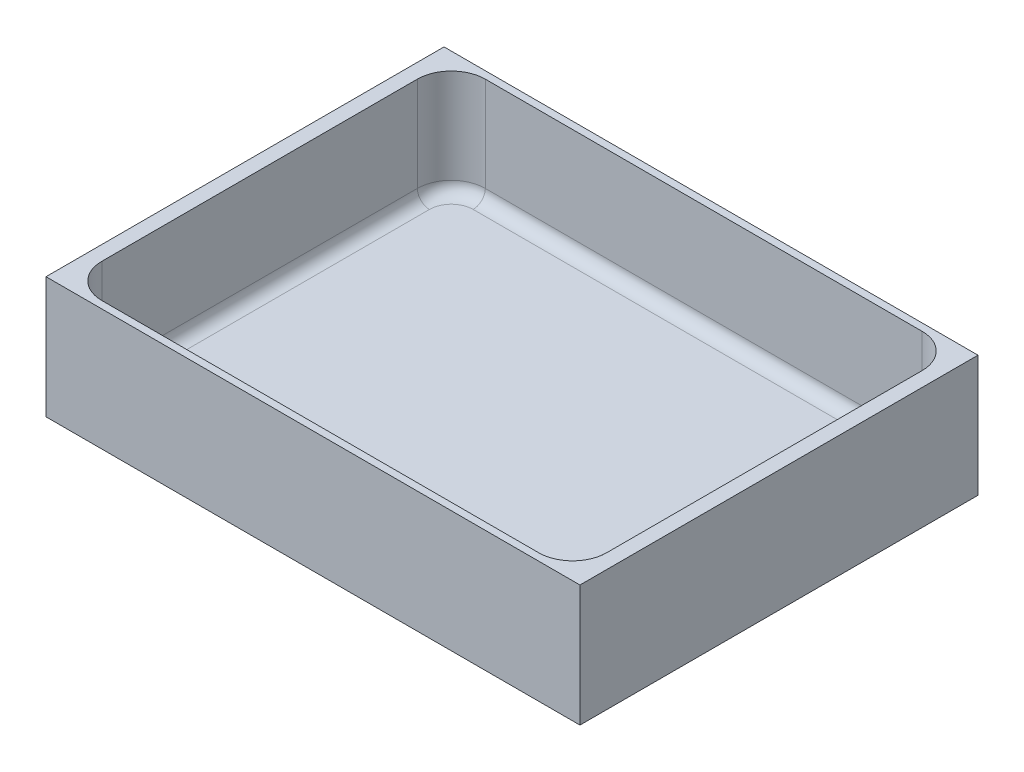
ISO-10303-21;
HEADER;
FILE_DESCRIPTION(('STEP AP214'),'2;1');
FILE_NAME('part.step','',(''),(''),'','','');
FILE_SCHEMA(('AUTOMOTIVE_DESIGN { 1 0 10303 214 1 1 1 1 }'));
ENDSEC;
DATA;
#1=APPLICATION_CONTEXT('core data for automotive mechanical design processes');
#2=APPLICATION_PROTOCOL_DEFINITION('international standard','automotive_design',2000,#1);
#3=PRODUCT_CONTEXT('',#1,'mechanical');
#4=PRODUCT('Part','Part','',(#3));
#5=PRODUCT_RELATED_PRODUCT_CATEGORY('part','',(#4));
#6=PRODUCT_DEFINITION_FORMATION('','',#4);
#7=PRODUCT_DEFINITION_CONTEXT('part definition',#1,'design');
#8=PRODUCT_DEFINITION('design','',#6,#7);
#9=PRODUCT_DEFINITION_SHAPE('','',#8);
#10=(LENGTH_UNIT() NAMED_UNIT(*) SI_UNIT(.MILLI.,.METRE.));
#11=(NAMED_UNIT(*) PLANE_ANGLE_UNIT() SI_UNIT($,.RADIAN.));
#12=(NAMED_UNIT(*) SI_UNIT($,.STERADIAN.) SOLID_ANGLE_UNIT());
#13=UNCERTAINTY_MEASURE_WITH_UNIT(LENGTH_MEASURE(1.E-05),#10,'distance_accuracy_value','');
#14=(GEOMETRIC_REPRESENTATION_CONTEXT(3) GLOBAL_UNCERTAINTY_ASSIGNED_CONTEXT((#13)) GLOBAL_UNIT_ASSIGNED_CONTEXT((#10,
#11,#12)) REPRESENTATION_CONTEXT('',''));
#15=CARTESIAN_POINT('',(0.,0.,0.));
#16=DIRECTION('',(0.,0.,1.));
#17=DIRECTION('',(1.,0.,0.));
#18=AXIS2_PLACEMENT_3D('',#15,#16,#17);
#19=CARTESIAN_POINT('',(-55.,25.,-41.));
#20=DIRECTION('',(-1.,0.,0.));
#21=DIRECTION('',(0.,0.,1.));
#22=AXIS2_PLACEMENT_3D('',#19,#20,#21);
#23=PLANE('',#22);
#24=DIRECTION('',(0.,0.,1.));
#25=VECTOR('',#24,1.);
#26=CARTESIAN_POINT('',(-55.,20.,-41.));
#27=LINE('',#26,#25);
#28=CARTESIAN_POINT('',(-55.,20.,-41.));
#29=VERTEX_POINT('',#28);
#30=CARTESIAN_POINT('',(-55.,20.,41.));
#31=VERTEX_POINT('',#30);
#32=EDGE_CURVE('E240',#29,#31,#27,.T.);
#33=ORIENTED_EDGE('',*,*,#32,.F.);
#34=DIRECTION('',(0.,-1.,0.));
#35=VECTOR('',#34,1.);
#36=CARTESIAN_POINT('',(-55.,25.,-41.));
#37=LINE('',#36,#35);
#38=CARTESIAN_POINT('',(-55.,-5.,-41.));
#39=VERTEX_POINT('',#38);
#40=EDGE_CURVE('E255',#29,#39,#37,.T.);
#41=ORIENTED_EDGE('',*,*,#40,.T.);
#42=DIRECTION('',(0.,0.,-1.));
#43=VECTOR('',#42,1.);
#44=CARTESIAN_POINT('',(-55.,-5.,-41.));
#45=LINE('',#44,#43);
#46=CARTESIAN_POINT('',(-55.,-5.,41.));
#47=VERTEX_POINT('',#46);
#48=EDGE_CURVE('E243',#47,#39,#45,.T.);
#49=ORIENTED_EDGE('',*,*,#48,.F.);
#50=DIRECTION('',(0.,-1.,0.));
#51=VECTOR('',#50,1.);
#52=CARTESIAN_POINT('',(-55.,25.,41.));
#53=LINE('',#52,#51);
#54=EDGE_CURVE('E237',#31,#47,#53,.T.);
#55=ORIENTED_EDGE('',*,*,#54,.F.);
#56=EDGE_LOOP('',(#33,#41,#49,#55));
#57=FACE_BOUND('',#56,.T.);
#58=ADVANCED_FACE('F36',(#57),#23,.T.);
#59=CARTESIAN_POINT('',(55.,25.,41.));
#60=DIRECTION('',(0.,0.,1.));
#61=DIRECTION('',(1.,0.,0.));
#62=AXIS2_PLACEMENT_3D('',#59,#60,#61);
#63=PLANE('',#62);
#64=DIRECTION('',(1.,0.,0.));
#65=VECTOR('',#64,1.);
#66=CARTESIAN_POINT('',(55.,20.,41.));
#67=LINE('',#66,#65);
#68=CARTESIAN_POINT('',(55.,20.,41.));
#69=VERTEX_POINT('',#68);
#70=EDGE_CURVE('E236',#31,#69,#67,.T.);
#71=ORIENTED_EDGE('',*,*,#70,.F.);
#72=ORIENTED_EDGE('',*,*,#54,.T.);
#73=DIRECTION('',(-1.,0.,0.));
#74=VECTOR('',#73,1.);
#75=CARTESIAN_POINT('',(55.,-5.,41.));
#76=LINE('',#75,#74);
#77=CARTESIAN_POINT('',(55.,-5.,41.));
#78=VERTEX_POINT('',#77);
#79=EDGE_CURVE('E252',#78,#47,#76,.T.);
#80=ORIENTED_EDGE('',*,*,#79,.F.);
#81=DIRECTION('',(0.,-1.,0.));
#82=VECTOR('',#81,1.);
#83=CARTESIAN_POINT('',(55.,25.,41.));
#84=LINE('',#83,#82);
#85=EDGE_CURVE('E258',#69,#78,#84,.T.);
#86=ORIENTED_EDGE('',*,*,#85,.F.);
#87=EDGE_LOOP('',(#71,#72,#80,#86));
#88=FACE_BOUND('',#87,.T.);
#89=ADVANCED_FACE('F289',(#88),#63,.T.);
#90=CARTESIAN_POINT('',(55.,25.,-41.));
#91=DIRECTION('',(1.,0.,0.));
#92=DIRECTION('',(0.,0.,-1.));
#93=AXIS2_PLACEMENT_3D('',#90,#91,#92);
#94=PLANE('',#93);
#95=DIRECTION('',(0.,0.,-1.));
#96=VECTOR('',#95,1.);
#97=CARTESIAN_POINT('',(55.,20.,-41.));
#98=LINE('',#97,#96);
#99=CARTESIAN_POINT('',(55.,20.,-41.));
#100=VERTEX_POINT('',#99);
#101=EDGE_CURVE('E233',#69,#100,#98,.T.);
#102=ORIENTED_EDGE('',*,*,#101,.F.);
#103=ORIENTED_EDGE('',*,*,#85,.T.);
#104=DIRECTION('',(0.,0.,1.));
#105=VECTOR('',#104,1.);
#106=CARTESIAN_POINT('',(55.,-5.,-41.));
#107=LINE('',#106,#105);
#108=CARTESIAN_POINT('',(55.,-5.,-41.));
#109=VERTEX_POINT('',#108);
#110=EDGE_CURVE('E249',#109,#78,#107,.T.);
#111=ORIENTED_EDGE('',*,*,#110,.F.);
#112=DIRECTION('',(0.,-1.,0.));
#113=VECTOR('',#112,1.);
#114=CARTESIAN_POINT('',(55.,25.,-41.));
#115=LINE('',#114,#113);
#116=EDGE_CURVE('E261',#100,#109,#115,.T.);
#117=ORIENTED_EDGE('',*,*,#116,.F.);
#118=EDGE_LOOP('',(#102,#103,#111,#117));
#119=FACE_BOUND('',#118,.T.);
#120=ADVANCED_FACE('F302',(#119),#94,.T.);
#121=CARTESIAN_POINT('',(55.,25.,-41.));
#122=DIRECTION('',(0.,0.,-1.));
#123=DIRECTION('',(-1.,0.,0.));
#124=AXIS2_PLACEMENT_3D('',#121,#122,#123);
#125=PLANE('',#124);
#126=DIRECTION('',(-1.,0.,0.));
#127=VECTOR('',#126,1.);
#128=CARTESIAN_POINT('',(55.,20.,-41.));
#129=LINE('',#128,#127);
#130=EDGE_CURVE('E39',#100,#29,#129,.T.);
#131=ORIENTED_EDGE('',*,*,#130,.F.);
#132=ORIENTED_EDGE('',*,*,#116,.T.);
#133=DIRECTION('',(1.,0.,0.));
#134=VECTOR('',#133,1.);
#135=CARTESIAN_POINT('',(55.,-5.,-41.));
#136=LINE('',#135,#134);
#137=EDGE_CURVE('E246',#39,#109,#136,.T.);
#138=ORIENTED_EDGE('',*,*,#137,.F.);
#139=ORIENTED_EDGE('',*,*,#40,.F.);
#140=EDGE_LOOP('',(#131,#132,#138,#139));
#141=FACE_BOUND('',#140,.T.);
#142=ADVANCED_FACE('F277',(#141),#125,.T.);
#143=CARTESIAN_POINT('',(0.,-5.,0.));
#144=DIRECTION('',(0.,-1.,0.));
#145=DIRECTION('',(0.,0.,-1.));
#146=AXIS2_PLACEMENT_3D('',#143,#144,#145);
#147=PLANE('',#146);
#148=ORIENTED_EDGE('',*,*,#48,.T.);
#149=ORIENTED_EDGE('',*,*,#137,.T.);
#150=ORIENTED_EDGE('',*,*,#110,.T.);
#151=ORIENTED_EDGE('',*,*,#79,.T.);
#152=EDGE_LOOP('',(#148,#149,#150,#151));
#153=FACE_BOUND('',#152,.T.);
#154=ADVANCED_FACE('F281',(#153),#147,.T.);
#155=CARTESIAN_POINT('',(0.,-2.,0.));
#156=DIRECTION('',(0.,-1.,0.));
#157=DIRECTION('',(0.,0.,-1.));
#158=AXIS2_PLACEMENT_3D('',#155,#156,#157);
#159=PLANE('',#158);
#160=DIRECTION('',(0.,0.,-1.));
#161=VECTOR('',#160,1.);
#162=CARTESIAN_POINT('',(49.5,-2.,0.));
#163=LINE('',#162,#161);
#164=CARTESIAN_POINT('',(49.5,-2.,-32.5));
#165=VERTEX_POINT('',#164);
#166=CARTESIAN_POINT('',(49.5,-2.,32.5));
#167=VERTEX_POINT('',#166);
#168=EDGE_CURVE('E192',#165,#167,#163,.F.);
#169=ORIENTED_EDGE('',*,*,#168,.F.);
#170=CARTESIAN_POINT('',(45.,-2.,-32.5));
#171=DIRECTION('',(0.,-1.,0.));
#172=DIRECTION('',(0.,0.,-1.));
#173=AXIS2_PLACEMENT_3D('',#170,#171,#172);
#174=CIRCLE('',#173,4.49999999999999);
#175=CARTESIAN_POINT('',(45.,-2.,-37.));
#176=VERTEX_POINT('',#175);
#177=EDGE_CURVE('E182',#176,#165,#174,.T.);
#178=ORIENTED_EDGE('',*,*,#177,.F.);
#179=DIRECTION('',(1.,0.,0.));
#180=VECTOR('',#179,1.);
#181=CARTESIAN_POINT('',(0.,-2.,-37.));
#182=LINE('',#181,#180);
#183=CARTESIAN_POINT('',(-45.,-2.,-37.));
#184=VERTEX_POINT('',#183);
#185=EDGE_CURVE('E175',#184,#176,#182,.T.);
#186=ORIENTED_EDGE('',*,*,#185,.F.);
#187=CARTESIAN_POINT('',(-45.,-2.,-32.5));
#188=DIRECTION('',(0.,-1.,0.));
#189=DIRECTION('',(0.,0.,-1.));
#190=AXIS2_PLACEMENT_3D('',#187,#188,#189);
#191=CIRCLE('',#190,4.50000000000002);
#192=CARTESIAN_POINT('',(-49.5,-2.,-32.5));
#193=VERTEX_POINT('',#192);
#194=EDGE_CURVE('E168',#193,#184,#191,.T.);
#195=ORIENTED_EDGE('',*,*,#194,.F.);
#196=DIRECTION('',(0.,0.,-1.));
#197=VECTOR('',#196,1.);
#198=CARTESIAN_POINT('',(-49.5,-2.,0.));
#199=LINE('',#198,#197);
#200=CARTESIAN_POINT('',(-49.5,-2.,32.5));
#201=VERTEX_POINT('',#200);
#202=EDGE_CURVE('E163',#201,#193,#199,.T.);
#203=ORIENTED_EDGE('',*,*,#202,.F.);
#204=CARTESIAN_POINT('',(-45.,-2.,32.5));
#205=DIRECTION('',(0.,-1.,0.));
#206=DIRECTION('',(0.,0.,-1.));
#207=AXIS2_PLACEMENT_3D('',#204,#205,#206);
#208=CIRCLE('',#207,4.50000000000002);
#209=CARTESIAN_POINT('',(-45.,-2.,37.));
#210=VERTEX_POINT('',#209);
#211=EDGE_CURVE('E153',#210,#201,#208,.T.);
#212=ORIENTED_EDGE('',*,*,#211,.F.);
#213=DIRECTION('',(1.,0.,0.));
#214=VECTOR('',#213,1.);
#215=CARTESIAN_POINT('',(0.,-2.,37.));
#216=LINE('',#215,#214);
#217=CARTESIAN_POINT('',(45.,-2.,37.));
#218=VERTEX_POINT('',#217);
#219=EDGE_CURVE('E164',#218,#210,#216,.F.);
#220=ORIENTED_EDGE('',*,*,#219,.F.);
#221=CARTESIAN_POINT('',(45.,-2.,32.5));
#222=DIRECTION('',(0.,-1.,0.));
#223=DIRECTION('',(0.,0.,-1.));
#224=AXIS2_PLACEMENT_3D('',#221,#222,#223);
#225=CIRCLE('',#224,4.49999999999999);
#226=EDGE_CURVE('E195',#167,#218,#225,.T.);
#227=ORIENTED_EDGE('',*,*,#226,.F.);
#228=EDGE_LOOP('',(#169,#178,#186,#195,#203,#212,#220,#227));
#229=FACE_BOUND('',#228,.T.);
#230=ADVANCED_FACE('F338',(#229),#159,.F.);
#231=CARTESIAN_POINT('',(45.,0.5,32.5));
#232=DIRECTION('',(0.,-1.,0.));
#233=DIRECTION('',(0.,0.,-1.));
#234=AXIS2_PLACEMENT_3D('',#231,#232,#233);
#235=TOROIDAL_SURFACE('',#234,4.5,2.5);
#236=CARTESIAN_POINT('',(49.5,0.5,32.5));
#237=DIRECTION('',(0.,0.,-1.));
#238=DIRECTION('',(-1.,0.,0.));
#239=AXIS2_PLACEMENT_3D('',#236,#237,#238);
#240=CIRCLE('',#239,2.5);
#241=CARTESIAN_POINT('',(52.,0.5,32.5));
#242=VERTEX_POINT('',#241);
#243=EDGE_CURVE('E188',#167,#242,#240,.F.);
#244=ORIENTED_EDGE('',*,*,#243,.F.);
#245=ORIENTED_EDGE('',*,*,#226,.T.);
#246=CARTESIAN_POINT('',(45.,0.5,37.));
#247=DIRECTION('',(1.,0.,0.));
#248=DIRECTION('',(0.,0.,-1.));
#249=AXIS2_PLACEMENT_3D('',#246,#247,#248);
#250=CIRCLE('',#249,2.5);
#251=CARTESIAN_POINT('',(45.,0.5,39.5));
#252=VERTEX_POINT('',#251);
#253=EDGE_CURVE('E160',#252,#218,#250,.T.);
#254=ORIENTED_EDGE('',*,*,#253,.F.);
#255=CARTESIAN_POINT('',(45.,0.5,32.5));
#256=DIRECTION('',(0.,-1.,0.));
#257=DIRECTION('',(0.,0.,-1.));
#258=AXIS2_PLACEMENT_3D('',#255,#256,#257);
#259=CIRCLE('',#258,7.);
#260=EDGE_CURVE('E191',#252,#242,#259,.F.);
#261=ORIENTED_EDGE('',*,*,#260,.T.);
#262=EDGE_LOOP('',(#244,#245,#254,#261));
#263=FACE_BOUND('',#262,.T.);
#264=ADVANCED_FACE('F347',(#263),#235,.F.);
#265=CARTESIAN_POINT('',(49.5,0.5,37.5));
#266=DIRECTION('',(0.,0.,1.));
#267=DIRECTION('',(1.,0.,0.));
#268=AXIS2_PLACEMENT_3D('',#265,#266,#267);
#269=CYLINDRICAL_SURFACE('',#268,2.5);
#270=CARTESIAN_POINT('',(49.5,0.5,-32.5));
#271=DIRECTION('',(0.,0.,1.));
#272=DIRECTION('',(1.,0.,0.));
#273=AXIS2_PLACEMENT_3D('',#270,#271,#272);
#274=CIRCLE('',#273,2.5);
#275=CARTESIAN_POINT('',(52.,0.5,-32.5));
#276=VERTEX_POINT('',#275);
#277=EDGE_CURVE('E183',#165,#276,#274,.T.);
#278=ORIENTED_EDGE('',*,*,#277,.F.);
#279=ORIENTED_EDGE('',*,*,#168,.T.);
#280=ORIENTED_EDGE('',*,*,#243,.T.);
#281=DIRECTION('',(0.,0.,1.));
#282=VECTOR('',#281,1.);
#283=CARTESIAN_POINT('',(52.,0.5,37.5));
#284=LINE('',#283,#282);
#285=EDGE_CURVE('E179',#242,#276,#284,.F.);
#286=ORIENTED_EDGE('',*,*,#285,.T.);
#287=EDGE_LOOP('',(#278,#279,#280,#286));
#288=FACE_BOUND('',#287,.T.);
#289=ADVANCED_FACE('F358',(#288),#269,.F.);
#290=CARTESIAN_POINT('',(45.,0.5,-32.5));
#291=DIRECTION('',(0.,-1.,0.));
#292=DIRECTION('',(0.,0.,-1.));
#293=AXIS2_PLACEMENT_3D('',#290,#291,#292);
#294=TOROIDAL_SURFACE('',#293,4.5,2.5);
#295=CARTESIAN_POINT('',(45.,0.5,-37.));
#296=DIRECTION('',(-1.,0.,0.));
#297=DIRECTION('',(0.,0.,1.));
#298=AXIS2_PLACEMENT_3D('',#295,#296,#297);
#299=CIRCLE('',#298,2.5);
#300=CARTESIAN_POINT('',(45.,0.5,-39.5));
#301=VERTEX_POINT('',#300);
#302=EDGE_CURVE('E176',#176,#301,#299,.F.);
#303=ORIENTED_EDGE('',*,*,#302,.F.);
#304=ORIENTED_EDGE('',*,*,#177,.T.);
#305=ORIENTED_EDGE('',*,*,#277,.T.);
#306=CARTESIAN_POINT('',(45.,0.5,-32.5));
#307=DIRECTION('',(0.,-1.,0.));
#308=DIRECTION('',(0.,0.,-1.));
#309=AXIS2_PLACEMENT_3D('',#306,#307,#308);
#310=CIRCLE('',#309,7.);
#311=EDGE_CURVE('E172',#276,#301,#310,.F.);
#312=ORIENTED_EDGE('',*,*,#311,.T.);
#313=EDGE_LOOP('',(#303,#304,#305,#312));
#314=FACE_BOUND('',#313,.T.);
#315=ADVANCED_FACE('F369',(#314),#294,.F.);
#316=CARTESIAN_POINT('',(-50.,0.5,-37.));
#317=DIRECTION('',(1.,0.,0.));
#318=DIRECTION('',(0.,0.,-1.));
#319=AXIS2_PLACEMENT_3D('',#316,#317,#318);
#320=CYLINDRICAL_SURFACE('',#319,2.5);
#321=CARTESIAN_POINT('',(-45.,0.5,-37.));
#322=DIRECTION('',(1.,0.,0.));
#323=DIRECTION('',(0.,0.,-1.));
#324=AXIS2_PLACEMENT_3D('',#321,#322,#323);
#325=CIRCLE('',#324,2.5);
#326=CARTESIAN_POINT('',(-45.,0.5,-39.5));
#327=VERTEX_POINT('',#326);
#328=EDGE_CURVE('E169',#184,#327,#325,.T.);
#329=ORIENTED_EDGE('',*,*,#328,.F.);
#330=ORIENTED_EDGE('',*,*,#185,.T.);
#331=ORIENTED_EDGE('',*,*,#302,.T.);
#332=DIRECTION('',(1.,0.,0.));
#333=VECTOR('',#332,1.);
#334=CARTESIAN_POINT('',(-50.,0.5,-39.5));
#335=LINE('',#334,#333);
#336=EDGE_CURVE('E166',#301,#327,#335,.F.);
#337=ORIENTED_EDGE('',*,*,#336,.T.);
#338=EDGE_LOOP('',(#329,#330,#331,#337));
#339=FACE_BOUND('',#338,.T.);
#340=ADVANCED_FACE('F380',(#339),#320,.F.);
#341=CARTESIAN_POINT('',(-45.,0.5,-32.5));
#342=DIRECTION('',(0.,-1.,0.));
#343=DIRECTION('',(0.,0.,-1.));
#344=AXIS2_PLACEMENT_3D('',#341,#342,#343);
#345=TOROIDAL_SURFACE('',#344,4.5,2.5);
#346=CARTESIAN_POINT('',(-49.5,0.5,-32.5));
#347=DIRECTION('',(0.,0.,-1.));
#348=DIRECTION('',(-1.,0.,0.));
#349=AXIS2_PLACEMENT_3D('',#346,#347,#348);
#350=CIRCLE('',#349,2.5);
#351=CARTESIAN_POINT('',(-52.,0.5,-32.5));
#352=VERTEX_POINT('',#351);
#353=EDGE_CURVE('E149',#352,#193,#350,.F.);
#354=ORIENTED_EDGE('',*,*,#353,.T.);
#355=ORIENTED_EDGE('',*,*,#194,.T.);
#356=ORIENTED_EDGE('',*,*,#328,.T.);
#357=CARTESIAN_POINT('',(-45.,0.5,-32.5));
#358=DIRECTION('',(0.,-1.,0.));
#359=DIRECTION('',(0.,0.,-1.));
#360=AXIS2_PLACEMENT_3D('',#357,#358,#359);
#361=CIRCLE('',#360,7.);
#362=EDGE_CURVE('E155',#327,#352,#361,.F.);
#363=ORIENTED_EDGE('',*,*,#362,.T.);
#364=EDGE_LOOP('',(#354,#355,#356,#363));
#365=FACE_BOUND('',#364,.T.);
#366=ADVANCED_FACE('F391',(#365),#345,.F.);
#367=CARTESIAN_POINT('',(-49.5,0.5,37.5));
#368=DIRECTION('',(0.,0.,-1.));
#369=DIRECTION('',(-1.,0.,0.));
#370=AXIS2_PLACEMENT_3D('',#367,#368,#369);
#371=CYLINDRICAL_SURFACE('',#370,2.5);
#372=ORIENTED_EDGE('',*,*,#353,.F.);
#373=DIRECTION('',(0.,0.,-1.));
#374=VECTOR('',#373,1.);
#375=CARTESIAN_POINT('',(-52.,0.5,37.5));
#376=LINE('',#375,#374);
#377=CARTESIAN_POINT('',(-52.,0.5,32.5));
#378=VERTEX_POINT('',#377);
#379=EDGE_CURVE('E130',#352,#378,#376,.F.);
#380=ORIENTED_EDGE('',*,*,#379,.T.);
#381=CARTESIAN_POINT('',(-49.5,0.5,32.5));
#382=DIRECTION('',(0.,0.,1.));
#383=DIRECTION('',(1.,0.,0.));
#384=AXIS2_PLACEMENT_3D('',#381,#382,#383);
#385=CIRCLE('',#384,2.5);
#386=EDGE_CURVE('E147',#378,#201,#385,.T.);
#387=ORIENTED_EDGE('',*,*,#386,.T.);
#388=ORIENTED_EDGE('',*,*,#202,.T.);
#389=EDGE_LOOP('',(#372,#380,#387,#388));
#390=FACE_BOUND('',#389,.T.);
#391=ADVANCED_FACE('F145',(#390),#371,.F.);
#392=CARTESIAN_POINT('',(-45.,0.5,32.5));
#393=DIRECTION('',(0.,-1.,0.));
#394=DIRECTION('',(0.,0.,-1.));
#395=AXIS2_PLACEMENT_3D('',#392,#393,#394);
#396=TOROIDAL_SURFACE('',#395,4.5,2.5);
#397=ORIENTED_EDGE('',*,*,#386,.F.);
#398=CARTESIAN_POINT('',(-45.,0.5,32.5));
#399=DIRECTION('',(0.,-1.,0.));
#400=DIRECTION('',(0.,0.,-1.));
#401=AXIS2_PLACEMENT_3D('',#398,#399,#400);
#402=CIRCLE('',#401,7.);
#403=CARTESIAN_POINT('',(-45.,0.5,39.5));
#404=VERTEX_POINT('',#403);
#405=EDGE_CURVE('E124',#378,#404,#402,.F.);
#406=ORIENTED_EDGE('',*,*,#405,.T.);
#407=CARTESIAN_POINT('',(-45.,0.5,37.));
#408=DIRECTION('',(-1.,0.,0.));
#409=DIRECTION('',(0.,0.,1.));
#410=AXIS2_PLACEMENT_3D('',#407,#408,#409);
#411=CIRCLE('',#410,2.5);
#412=EDGE_CURVE('E141',#404,#210,#411,.F.);
#413=ORIENTED_EDGE('',*,*,#412,.T.);
#414=ORIENTED_EDGE('',*,*,#211,.T.);
#415=EDGE_LOOP('',(#397,#406,#413,#414));
#416=FACE_BOUND('',#415,.T.);
#417=ADVANCED_FACE('F151',(#416),#396,.F.);
#418=CARTESIAN_POINT('',(-50.,0.5,37.));
#419=DIRECTION('',(-1.,0.,0.));
#420=DIRECTION('',(0.,0.,1.));
#421=AXIS2_PLACEMENT_3D('',#418,#419,#420);
#422=CYLINDRICAL_SURFACE('',#421,2.5);
#423=ORIENTED_EDGE('',*,*,#412,.F.);
#424=DIRECTION('',(-1.,0.,0.));
#425=VECTOR('',#424,1.);
#426=CARTESIAN_POINT('',(-50.,0.5,39.5));
#427=LINE('',#426,#425);
#428=EDGE_CURVE('E140',#404,#252,#427,.F.);
#429=ORIENTED_EDGE('',*,*,#428,.T.);
#430=ORIENTED_EDGE('',*,*,#253,.T.);
#431=ORIENTED_EDGE('',*,*,#219,.T.);
#432=EDGE_LOOP('',(#423,#429,#430,#431));
#433=FACE_BOUND('',#432,.T.);
#434=ADVANCED_FACE('F421',(#433),#422,.F.);
#435=CARTESIAN_POINT('',(-50.,20.,39.5));
#436=DIRECTION('',(0.,0.,-1.));
#437=DIRECTION('',(-1.,0.,0.));
#438=AXIS2_PLACEMENT_3D('',#435,#436,#437);
#439=PLANE('',#438);
#440=DIRECTION('',(0.,1.,0.));
#441=VECTOR('',#440,1.);
#442=CARTESIAN_POINT('',(-45.,20.,39.5));
#443=LINE('',#442,#441);
#444=CARTESIAN_POINT('',(-45.,20.,39.5));
#445=VERTEX_POINT('',#444);
#446=EDGE_CURVE('E138',#445,#404,#443,.F.);
#447=ORIENTED_EDGE('',*,*,#446,.F.);
#448=DIRECTION('',(1.,0.,0.));
#449=VECTOR('',#448,1.);
#450=CARTESIAN_POINT('',(0.,20.,39.5));
#451=LINE('',#450,#449);
#452=CARTESIAN_POINT('',(45.,20.,39.5));
#453=VERTEX_POINT('',#452);
#454=EDGE_CURVE('E198',#445,#453,#451,.T.);
#455=ORIENTED_EDGE('',*,*,#454,.T.);
#456=DIRECTION('',(0.,1.,0.));
#457=VECTOR('',#456,1.);
#458=CARTESIAN_POINT('',(45.,20.,39.5));
#459=LINE('',#458,#457);
#460=EDGE_CURVE('E202',#252,#453,#459,.T.);
#461=ORIENTED_EDGE('',*,*,#460,.F.);
#462=ORIENTED_EDGE('',*,*,#428,.F.);
#463=EDGE_LOOP('',(#447,#455,#461,#462));
#464=FACE_BOUND('',#463,.T.);
#465=ADVANCED_FACE('F431',(#464),#439,.T.);
#466=CARTESIAN_POINT('',(45.,20.,32.5));
#467=DIRECTION('',(0.,-1.,0.));
#468=DIRECTION('',(0.,0.,-1.));
#469=AXIS2_PLACEMENT_3D('',#466,#467,#468);
#470=CYLINDRICAL_SURFACE('',#469,7.);
#471=ORIENTED_EDGE('',*,*,#460,.T.);
#472=CARTESIAN_POINT('',(45.,20.,32.5));
#473=DIRECTION('',(0.,-1.,0.));
#474=DIRECTION('',(0.,0.,-1.));
#475=AXIS2_PLACEMENT_3D('',#472,#473,#474);
#476=CIRCLE('',#475,7.);
#477=CARTESIAN_POINT('',(52.,20.,32.5));
#478=VERTEX_POINT('',#477);
#479=EDGE_CURVE('E206',#453,#478,#476,.F.);
#480=ORIENTED_EDGE('',*,*,#479,.T.);
#481=DIRECTION('',(0.,1.,0.));
#482=VECTOR('',#481,1.);
#483=CARTESIAN_POINT('',(52.,20.,32.5));
#484=LINE('',#483,#482);
#485=EDGE_CURVE('E201',#478,#242,#484,.F.);
#486=ORIENTED_EDGE('',*,*,#485,.T.);
#487=ORIENTED_EDGE('',*,*,#260,.F.);
#488=EDGE_LOOP('',(#471,#480,#486,#487));
#489=FACE_BOUND('',#488,.T.);
#490=ADVANCED_FACE('F442',(#489),#470,.F.);
#491=CARTESIAN_POINT('',(52.,20.,37.5));
#492=DIRECTION('',(-1.,0.,0.));
#493=DIRECTION('',(0.,0.,1.));
#494=AXIS2_PLACEMENT_3D('',#491,#492,#493);
#495=PLANE('',#494);
#496=ORIENTED_EDGE('',*,*,#485,.F.);
#497=DIRECTION('',(0.,0.,-1.));
#498=VECTOR('',#497,1.);
#499=CARTESIAN_POINT('',(52.,20.,0.));
#500=LINE('',#499,#498);
#501=CARTESIAN_POINT('',(52.,20.,-32.5));
#502=VERTEX_POINT('',#501);
#503=EDGE_CURVE('E207',#478,#502,#500,.T.);
#504=ORIENTED_EDGE('',*,*,#503,.T.);
#505=DIRECTION('',(0.,1.,0.));
#506=VECTOR('',#505,1.);
#507=CARTESIAN_POINT('',(52.,20.,-32.5));
#508=LINE('',#507,#506);
#509=EDGE_CURVE('E211',#276,#502,#508,.T.);
#510=ORIENTED_EDGE('',*,*,#509,.F.);
#511=ORIENTED_EDGE('',*,*,#285,.F.);
#512=EDGE_LOOP('',(#496,#504,#510,#511));
#513=FACE_BOUND('',#512,.T.);
#514=ADVANCED_FACE('F453',(#513),#495,.T.);
#515=CARTESIAN_POINT('',(45.,20.,-32.5));
#516=DIRECTION('',(0.,-1.,0.));
#517=DIRECTION('',(0.,0.,-1.));
#518=AXIS2_PLACEMENT_3D('',#515,#516,#517);
#519=CYLINDRICAL_SURFACE('',#518,7.);
#520=ORIENTED_EDGE('',*,*,#509,.T.);
#521=CARTESIAN_POINT('',(45.,20.,-32.5));
#522=DIRECTION('',(0.,-1.,0.));
#523=DIRECTION('',(0.,0.,-1.));
#524=AXIS2_PLACEMENT_3D('',#521,#522,#523);
#525=CIRCLE('',#524,7.);
#526=CARTESIAN_POINT('',(45.,20.,-39.5));
#527=VERTEX_POINT('',#526);
#528=EDGE_CURVE('E215',#502,#527,#525,.F.);
#529=ORIENTED_EDGE('',*,*,#528,.T.);
#530=DIRECTION('',(0.,1.,0.));
#531=VECTOR('',#530,1.);
#532=CARTESIAN_POINT('',(45.,20.,-39.5));
#533=LINE('',#532,#531);
#534=EDGE_CURVE('E210',#527,#301,#533,.F.);
#535=ORIENTED_EDGE('',*,*,#534,.T.);
#536=ORIENTED_EDGE('',*,*,#311,.F.);
#537=EDGE_LOOP('',(#520,#529,#535,#536));
#538=FACE_BOUND('',#537,.T.);
#539=ADVANCED_FACE('F464',(#538),#519,.F.);
#540=CARTESIAN_POINT('',(-50.,20.,-39.5));
#541=DIRECTION('',(0.,0.,1.));
#542=DIRECTION('',(1.,0.,0.));
#543=AXIS2_PLACEMENT_3D('',#540,#541,#542);
#544=PLANE('',#543);
#545=ORIENTED_EDGE('',*,*,#534,.F.);
#546=DIRECTION('',(-1.,0.,0.));
#547=VECTOR('',#546,1.);
#548=CARTESIAN_POINT('',(0.,20.,-39.5));
#549=LINE('',#548,#547);
#550=CARTESIAN_POINT('',(-45.,20.,-39.5));
#551=VERTEX_POINT('',#550);
#552=EDGE_CURVE('E216',#527,#551,#549,.T.);
#553=ORIENTED_EDGE('',*,*,#552,.T.);
#554=DIRECTION('',(0.,1.,0.));
#555=VECTOR('',#554,1.);
#556=CARTESIAN_POINT('',(-45.,20.,-39.5));
#557=LINE('',#556,#555);
#558=EDGE_CURVE('E220',#327,#551,#557,.T.);
#559=ORIENTED_EDGE('',*,*,#558,.F.);
#560=ORIENTED_EDGE('',*,*,#336,.F.);
#561=EDGE_LOOP('',(#545,#553,#559,#560));
#562=FACE_BOUND('',#561,.T.);
#563=ADVANCED_FACE('F475',(#562),#544,.T.);
#564=CARTESIAN_POINT('',(-45.,20.,-32.5));
#565=DIRECTION('',(0.,-1.,0.));
#566=DIRECTION('',(0.,0.,-1.));
#567=AXIS2_PLACEMENT_3D('',#564,#565,#566);
#568=CYLINDRICAL_SURFACE('',#567,7.);
#569=ORIENTED_EDGE('',*,*,#558,.T.);
#570=CARTESIAN_POINT('',(-45.,20.,-32.5));
#571=DIRECTION('',(0.,-1.,0.));
#572=DIRECTION('',(0.,0.,-1.));
#573=AXIS2_PLACEMENT_3D('',#570,#571,#572);
#574=CIRCLE('',#573,7.);
#575=CARTESIAN_POINT('',(-52.,20.,-32.5));
#576=VERTEX_POINT('',#575);
#577=EDGE_CURVE('E134',#551,#576,#574,.F.);
#578=ORIENTED_EDGE('',*,*,#577,.T.);
#579=DIRECTION('',(0.,1.,0.));
#580=VECTOR('',#579,1.);
#581=CARTESIAN_POINT('',(-52.,20.,-32.5));
#582=LINE('',#581,#580);
#583=EDGE_CURVE('E219',#576,#352,#582,.F.);
#584=ORIENTED_EDGE('',*,*,#583,.T.);
#585=ORIENTED_EDGE('',*,*,#362,.F.);
#586=EDGE_LOOP('',(#569,#578,#584,#585));
#587=FACE_BOUND('',#586,.T.);
#588=ADVANCED_FACE('F486',(#587),#568,.F.);
#589=CARTESIAN_POINT('',(-52.,20.,37.5));
#590=DIRECTION('',(1.,0.,0.));
#591=DIRECTION('',(0.,0.,-1.));
#592=AXIS2_PLACEMENT_3D('',#589,#590,#591);
#593=PLANE('',#592);
#594=ORIENTED_EDGE('',*,*,#583,.F.);
#595=DIRECTION('',(0.,0.,1.));
#596=VECTOR('',#595,1.);
#597=CARTESIAN_POINT('',(-52.,20.,0.));
#598=LINE('',#597,#596);
#599=CARTESIAN_POINT('',(-52.,20.,32.5));
#600=VERTEX_POINT('',#599);
#601=EDGE_CURVE('E46',#576,#600,#598,.T.);
#602=ORIENTED_EDGE('',*,*,#601,.T.);
#603=DIRECTION('',(0.,1.,0.));
#604=VECTOR('',#603,1.);
#605=CARTESIAN_POINT('',(-52.,20.,32.5));
#606=LINE('',#605,#604);
#607=EDGE_CURVE('E127',#378,#600,#606,.T.);
#608=ORIENTED_EDGE('',*,*,#607,.F.);
#609=ORIENTED_EDGE('',*,*,#379,.F.);
#610=EDGE_LOOP('',(#594,#602,#608,#609));
#611=FACE_BOUND('',#610,.T.);
#612=ADVANCED_FACE('F128',(#611),#593,.T.);
#613=CARTESIAN_POINT('',(-45.,20.,32.5));
#614=DIRECTION('',(0.,-1.,0.));
#615=DIRECTION('',(0.,0.,-1.));
#616=AXIS2_PLACEMENT_3D('',#613,#614,#615);
#617=CYLINDRICAL_SURFACE('',#616,7.);
#618=ORIENTED_EDGE('',*,*,#607,.T.);
#619=CARTESIAN_POINT('',(-45.,20.,32.5));
#620=DIRECTION('',(0.,-1.,0.));
#621=DIRECTION('',(0.,0.,-1.));
#622=AXIS2_PLACEMENT_3D('',#619,#620,#621);
#623=CIRCLE('',#622,7.);
#624=EDGE_CURVE('E11',#600,#445,#623,.F.);
#625=ORIENTED_EDGE('',*,*,#624,.T.);
#626=ORIENTED_EDGE('',*,*,#446,.T.);
#627=ORIENTED_EDGE('',*,*,#405,.F.);
#628=EDGE_LOOP('',(#618,#625,#626,#627));
#629=FACE_BOUND('',#628,.T.);
#630=ADVANCED_FACE('F136',(#629),#617,.F.);
#631=CARTESIAN_POINT('',(-52.,20.,-32.5));
#632=DIRECTION('',(0.,-1.,0.));
#633=DIRECTION('',(0.,0.,1.));
#634=AXIS2_PLACEMENT_3D('',#631,#632,#633);
#635=PLANE('',#634);
#636=ORIENTED_EDGE('',*,*,#32,.T.);
#637=ORIENTED_EDGE('',*,*,#70,.T.);
#638=ORIENTED_EDGE('',*,*,#101,.T.);
#639=ORIENTED_EDGE('',*,*,#130,.T.);
#640=EDGE_LOOP('',(#636,#637,#638,#639));
#641=FACE_BOUND('',#640,.T.);
#642=ORIENTED_EDGE('',*,*,#503,.F.);
#643=ORIENTED_EDGE('',*,*,#479,.F.);
#644=ORIENTED_EDGE('',*,*,#454,.F.);
#645=ORIENTED_EDGE('',*,*,#624,.F.);
#646=ORIENTED_EDGE('',*,*,#601,.F.);
#647=ORIENTED_EDGE('',*,*,#577,.F.);
#648=ORIENTED_EDGE('',*,*,#552,.F.);
#649=ORIENTED_EDGE('',*,*,#528,.F.);
#650=EDGE_LOOP('',(#642,#643,#644,#645,#646,#647,#648,#649));
#651=FACE_BOUND('',#650,.T.);
#652=ADVANCED_FACE('F300',(#641,#651),#635,.F.);
#653=CLOSED_SHELL('',(#58,#89,#120,#142,#154,#230,#264,#289,#315,#340,#366,#391,#417,#434,#465,
#490,#514,#539,#563,#588,#612,#630,#652));
#654=MANIFOLD_SOLID_BREP('B2',#653);
#655=ADVANCED_BREP_SHAPE_REPRESENTATION('',(#18,#654),#14);
#656=SHAPE_DEFINITION_REPRESENTATION(#9,#655);
ENDSEC;
END-ISO-10303-21;
